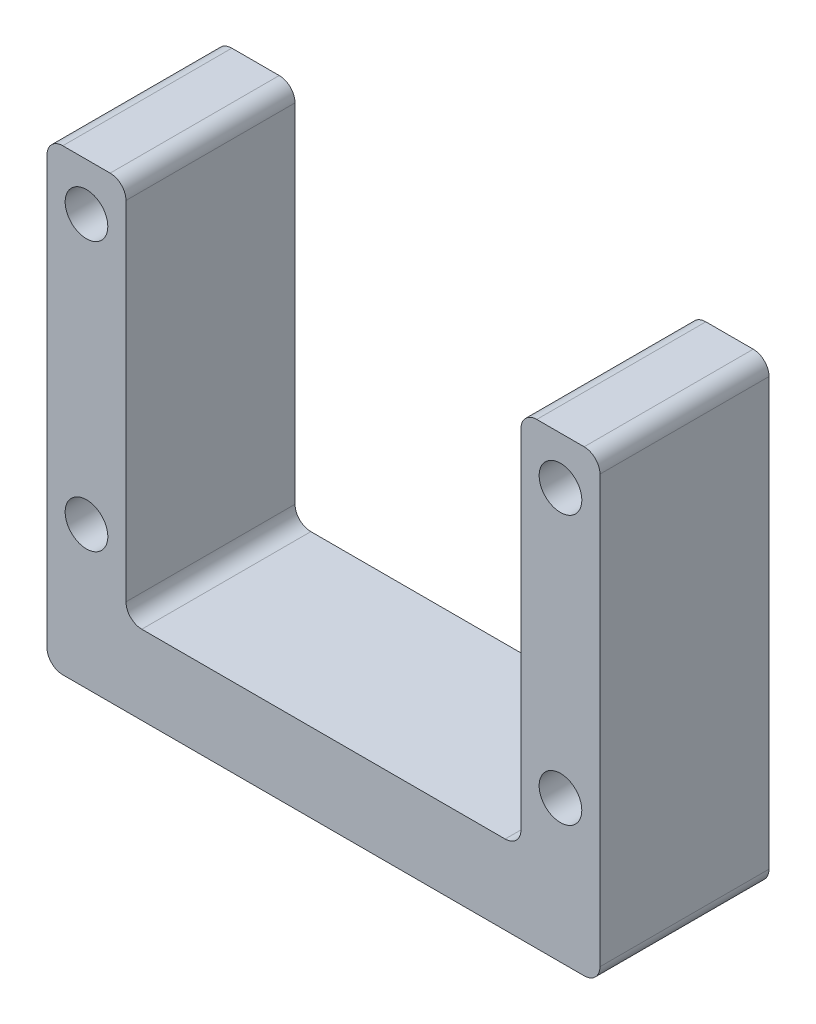
ISO-10303-21;
HEADER;
FILE_DESCRIPTION(('STEP AP214'),'2;1');
FILE_NAME('part.step','',(''),(''),'','','');
FILE_SCHEMA(('AUTOMOTIVE_DESIGN { 1 0 10303 214 1 1 1 1 }'));
ENDSEC;
DATA;
#1=APPLICATION_CONTEXT('core data for automotive mechanical design processes');
#2=APPLICATION_PROTOCOL_DEFINITION('international standard','automotive_design',2000,#1);
#3=PRODUCT_CONTEXT('',#1,'mechanical');
#4=PRODUCT('Part','Part','',(#3));
#5=PRODUCT_RELATED_PRODUCT_CATEGORY('part','',(#4));
#6=PRODUCT_DEFINITION_FORMATION('','',#4);
#7=PRODUCT_DEFINITION_CONTEXT('part definition',#1,'design');
#8=PRODUCT_DEFINITION('design','',#6,#7);
#9=PRODUCT_DEFINITION_SHAPE('','',#8);
#10=(LENGTH_UNIT() NAMED_UNIT(*) SI_UNIT(.MILLI.,.METRE.));
#11=(NAMED_UNIT(*) PLANE_ANGLE_UNIT() SI_UNIT($,.RADIAN.));
#12=(NAMED_UNIT(*) SI_UNIT($,.STERADIAN.) SOLID_ANGLE_UNIT());
#13=UNCERTAINTY_MEASURE_WITH_UNIT(LENGTH_MEASURE(1.E-05),#10,'distance_accuracy_value','');
#14=(GEOMETRIC_REPRESENTATION_CONTEXT(3) GLOBAL_UNCERTAINTY_ASSIGNED_CONTEXT((#13)) GLOBAL_UNIT_ASSIGNED_CONTEXT((#10,
#11,#12)) REPRESENTATION_CONTEXT('',''));
#15=CARTESIAN_POINT('',(0.,0.,0.));
#16=DIRECTION('',(0.,0.,1.));
#17=DIRECTION('',(1.,0.,0.));
#18=AXIS2_PLACEMENT_3D('',#15,#16,#17);
#19=CARTESIAN_POINT('',(12.5,0.,10.7));
#20=DIRECTION('',(1.,0.,0.));
#21=DIRECTION('',(0.,1.,0.));
#22=AXIS2_PLACEMENT_3D('',#19,#20,#21);
#23=PLANE('',#22);
#24=DIRECTION('',(0.,-1.,0.));
#25=VECTOR('',#24,1.);
#26=CARTESIAN_POINT('',(12.5,0.,10.7));
#27=LINE('',#26,#25);
#28=CARTESIAN_POINT('',(12.5,23.,10.7));
#29=VERTEX_POINT('',#28);
#30=CARTESIAN_POINT('',(12.5,1.,10.7));
#31=VERTEX_POINT('',#30);
#32=EDGE_CURVE('E165',#29,#31,#27,.T.);
#33=ORIENTED_EDGE('',*,*,#32,.F.);
#34=DIRECTION('',(0.,0.,-1.));
#35=VECTOR('',#34,1.);
#36=CARTESIAN_POINT('',(12.5,23.,10.7));
#37=LINE('',#36,#35);
#38=CARTESIAN_POINT('',(12.5,23.,0.));
#39=VERTEX_POINT('',#38);
#40=EDGE_CURVE('E150',#29,#39,#37,.T.);
#41=ORIENTED_EDGE('',*,*,#40,.T.);
#42=DIRECTION('',(0.,-1.,0.));
#43=VECTOR('',#42,1.);
#44=CARTESIAN_POINT('',(12.5,0.,0.));
#45=LINE('',#44,#43);
#46=CARTESIAN_POINT('',(12.5,1.,0.));
#47=VERTEX_POINT('',#46);
#48=EDGE_CURVE('E162',#39,#47,#45,.T.);
#49=ORIENTED_EDGE('',*,*,#48,.T.);
#50=DIRECTION('',(0.,0.,-1.));
#51=VECTOR('',#50,1.);
#52=CARTESIAN_POINT('',(12.5,1.,10.7));
#53=LINE('',#52,#51);
#54=EDGE_CURVE('E167',#47,#31,#53,.F.);
#55=ORIENTED_EDGE('',*,*,#54,.T.);
#56=EDGE_LOOP('',(#33,#41,#49,#55));
#57=FACE_BOUND('',#56,.T.);
#58=ADVANCED_FACE('F32',(#57),#23,.F.);
#59=CARTESIAN_POINT('',(-12.5,0.,10.7));
#60=DIRECTION('',(0.,-1.,0.));
#61=DIRECTION('',(0.,0.,-1.));
#62=AXIS2_PLACEMENT_3D('',#59,#60,#61);
#63=PLANE('',#62);
#64=DIRECTION('',(-1.,0.,0.));
#65=VECTOR('',#64,1.);
#66=CARTESIAN_POINT('',(-12.5,0.,10.7));
#67=LINE('',#66,#65);
#68=CARTESIAN_POINT('',(11.5,0.,10.7));
#69=VERTEX_POINT('',#68);
#70=CARTESIAN_POINT('',(-11.5,0.,10.7));
#71=VERTEX_POINT('',#70);
#72=EDGE_CURVE('E270',#69,#71,#67,.T.);
#73=ORIENTED_EDGE('',*,*,#72,.F.);
#74=DIRECTION('',(0.,0.,-1.));
#75=VECTOR('',#74,1.);
#76=CARTESIAN_POINT('',(11.5,0.,0.));
#77=LINE('',#76,#75);
#78=CARTESIAN_POINT('',(11.5,0.,0.));
#79=VERTEX_POINT('',#78);
#80=EDGE_CURVE('E249',#69,#79,#77,.T.);
#81=ORIENTED_EDGE('',*,*,#80,.T.);
#82=DIRECTION('',(-1.,0.,0.));
#83=VECTOR('',#82,1.);
#84=CARTESIAN_POINT('',(-12.5,0.,0.));
#85=LINE('',#84,#83);
#86=CARTESIAN_POINT('',(-11.5,0.,0.));
#87=VERTEX_POINT('',#86);
#88=EDGE_CURVE('E172',#79,#87,#85,.T.);
#89=ORIENTED_EDGE('',*,*,#88,.T.);
#90=DIRECTION('',(0.,0.,-1.));
#91=VECTOR('',#90,1.);
#92=CARTESIAN_POINT('',(-11.5,0.,10.7));
#93=LINE('',#92,#91);
#94=EDGE_CURVE('E247',#87,#71,#93,.F.);
#95=ORIENTED_EDGE('',*,*,#94,.T.);
#96=EDGE_LOOP('',(#73,#81,#89,#95));
#97=FACE_BOUND('',#96,.T.);
#98=ADVANCED_FACE('F260',(#97),#63,.F.);
#99=CARTESIAN_POINT('',(-12.5,0.,10.7));
#100=DIRECTION('',(-1.,0.,0.));
#101=DIRECTION('',(0.,-1.,0.));
#102=AXIS2_PLACEMENT_3D('',#99,#100,#101);
#103=PLANE('',#102);
#104=DIRECTION('',(0.,1.,0.));
#105=VECTOR('',#104,1.);
#106=CARTESIAN_POINT('',(-12.5,0.,0.));
#107=LINE('',#106,#105);
#108=CARTESIAN_POINT('',(-12.5,1.,0.));
#109=VERTEX_POINT('',#108);
#110=CARTESIAN_POINT('',(-12.5,23.,0.));
#111=VERTEX_POINT('',#110);
#112=EDGE_CURVE('E176',#109,#111,#107,.T.);
#113=ORIENTED_EDGE('',*,*,#112,.T.);
#114=DIRECTION('',(0.,0.,-1.));
#115=VECTOR('',#114,1.);
#116=CARTESIAN_POINT('',(-12.5,23.,10.7));
#117=LINE('',#116,#115);
#118=CARTESIAN_POINT('',(-12.5,23.,10.7));
#119=VERTEX_POINT('',#118);
#120=EDGE_CURVE('E231',#111,#119,#117,.F.);
#121=ORIENTED_EDGE('',*,*,#120,.T.);
#122=DIRECTION('',(0.,1.,0.));
#123=VECTOR('',#122,1.);
#124=CARTESIAN_POINT('',(-12.5,0.,10.7));
#125=LINE('',#124,#123);
#126=CARTESIAN_POINT('',(-12.5,1.,10.7));
#127=VERTEX_POINT('',#126);
#128=EDGE_CURVE('E268',#127,#119,#125,.T.);
#129=ORIENTED_EDGE('',*,*,#128,.F.);
#130=DIRECTION('',(0.,0.,-1.));
#131=VECTOR('',#130,1.);
#132=CARTESIAN_POINT('',(-12.5,1.,0.));
#133=LINE('',#132,#131);
#134=EDGE_CURVE('E228',#127,#109,#133,.T.);
#135=ORIENTED_EDGE('',*,*,#134,.T.);
#136=EDGE_LOOP('',(#113,#121,#129,#135));
#137=FACE_BOUND('',#136,.T.);
#138=ADVANCED_FACE('F272',(#137),#103,.F.);
#139=CARTESIAN_POINT('',(-12.5,24.,10.7));
#140=DIRECTION('',(0.,-1.,0.));
#141=DIRECTION('',(0.,0.,-1.));
#142=AXIS2_PLACEMENT_3D('',#139,#140,#141);
#143=PLANE('',#142);
#144=DIRECTION('',(-1.,0.,0.));
#145=VECTOR('',#144,1.);
#146=CARTESIAN_POINT('',(-12.5,24.,10.7));
#147=LINE('',#146,#145);
#148=CARTESIAN_POINT('',(-13.5,24.,10.7));
#149=VERTEX_POINT('',#148);
#150=CARTESIAN_POINT('',(-16.5,24.,10.7));
#151=VERTEX_POINT('',#150);
#152=EDGE_CURVE('E274',#149,#151,#147,.T.);
#153=ORIENTED_EDGE('',*,*,#152,.F.);
#154=DIRECTION('',(0.,0.,-1.));
#155=VECTOR('',#154,1.);
#156=CARTESIAN_POINT('',(-13.5,24.,10.7));
#157=LINE('',#156,#155);
#158=CARTESIAN_POINT('',(-13.5,24.,0.));
#159=VERTEX_POINT('',#158);
#160=EDGE_CURVE('E225',#149,#159,#157,.T.);
#161=ORIENTED_EDGE('',*,*,#160,.T.);
#162=DIRECTION('',(-1.,0.,0.));
#163=VECTOR('',#162,1.);
#164=CARTESIAN_POINT('',(-12.5,24.,0.));
#165=LINE('',#164,#163);
#166=CARTESIAN_POINT('',(-16.5,24.,0.));
#167=VERTEX_POINT('',#166);
#168=EDGE_CURVE('E187',#159,#167,#165,.T.);
#169=ORIENTED_EDGE('',*,*,#168,.T.);
#170=DIRECTION('',(0.,0.,-1.));
#171=VECTOR('',#170,1.);
#172=CARTESIAN_POINT('',(-16.5,24.,10.7));
#173=LINE('',#172,#171);
#174=EDGE_CURVE('E223',#167,#151,#173,.F.);
#175=ORIENTED_EDGE('',*,*,#174,.T.);
#176=EDGE_LOOP('',(#153,#161,#169,#175));
#177=FACE_BOUND('',#176,.T.);
#178=ADVANCED_FACE('F320',(#177),#143,.F.);
#179=CARTESIAN_POINT('',(-17.5,24.,10.7));
#180=DIRECTION('',(1.,0.,0.));
#181=DIRECTION('',(0.,1.,0.));
#182=AXIS2_PLACEMENT_3D('',#179,#180,#181);
#183=PLANE('',#182);
#184=DIRECTION('',(0.,-1.,0.));
#185=VECTOR('',#184,1.);
#186=CARTESIAN_POINT('',(-17.5,24.,0.));
#187=LINE('',#186,#185);
#188=CARTESIAN_POINT('',(-17.5,23.,0.));
#189=VERTEX_POINT('',#188);
#190=CARTESIAN_POINT('',(-17.5,-4.,0.));
#191=VERTEX_POINT('',#190);
#192=EDGE_CURVE('E190',#189,#191,#187,.T.);
#193=ORIENTED_EDGE('',*,*,#192,.T.);
#194=DIRECTION('',(0.,0.,-1.));
#195=VECTOR('',#194,1.);
#196=CARTESIAN_POINT('',(-17.5,-4.,10.7));
#197=LINE('',#196,#195);
#198=CARTESIAN_POINT('',(-17.5,-4.,10.7));
#199=VERTEX_POINT('',#198);
#200=EDGE_CURVE('E245',#191,#199,#197,.F.);
#201=ORIENTED_EDGE('',*,*,#200,.T.);
#202=DIRECTION('',(0.,-1.,0.));
#203=VECTOR('',#202,1.);
#204=CARTESIAN_POINT('',(-17.5,24.,10.7));
#205=LINE('',#204,#203);
#206=CARTESIAN_POINT('',(-17.5,23.,10.7));
#207=VERTEX_POINT('',#206);
#208=EDGE_CURVE('E277',#207,#199,#205,.T.);
#209=ORIENTED_EDGE('',*,*,#208,.F.);
#210=DIRECTION('',(0.,0.,-1.));
#211=VECTOR('',#210,1.);
#212=CARTESIAN_POINT('',(-17.5,23.,10.7));
#213=LINE('',#212,#211);
#214=EDGE_CURVE('E242',#207,#189,#213,.T.);
#215=ORIENTED_EDGE('',*,*,#214,.T.);
#216=EDGE_LOOP('',(#193,#201,#209,#215));
#217=FACE_BOUND('',#216,.T.);
#218=ADVANCED_FACE('F310',(#217),#183,.F.);
#219=CARTESIAN_POINT('',(17.5,-5.,10.7));
#220=DIRECTION('',(0.,1.,0.));
#221=DIRECTION('',(0.,0.,1.));
#222=AXIS2_PLACEMENT_3D('',#219,#220,#221);
#223=PLANE('',#222);
#224=DIRECTION('',(1.,0.,0.));
#225=VECTOR('',#224,1.);
#226=CARTESIAN_POINT('',(17.5,-5.,0.));
#227=LINE('',#226,#225);
#228=CARTESIAN_POINT('',(-16.5,-5.,0.));
#229=VERTEX_POINT('',#228);
#230=CARTESIAN_POINT('',(16.5,-5.,0.));
#231=VERTEX_POINT('',#230);
#232=EDGE_CURVE('E193',#229,#231,#227,.T.);
#233=ORIENTED_EDGE('',*,*,#232,.T.);
#234=DIRECTION('',(0.,0.,-1.));
#235=VECTOR('',#234,1.);
#236=CARTESIAN_POINT('',(16.5,-5.,10.7));
#237=LINE('',#236,#235);
#238=CARTESIAN_POINT('',(16.5,-5.,10.7));
#239=VERTEX_POINT('',#238);
#240=EDGE_CURVE('E240',#231,#239,#237,.F.);
#241=ORIENTED_EDGE('',*,*,#240,.T.);
#242=DIRECTION('',(1.,0.,0.));
#243=VECTOR('',#242,1.);
#244=CARTESIAN_POINT('',(17.5,-5.,10.7));
#245=LINE('',#244,#243);
#246=CARTESIAN_POINT('',(-16.5,-5.,10.7));
#247=VERTEX_POINT('',#246);
#248=EDGE_CURVE('E284',#247,#239,#245,.T.);
#249=ORIENTED_EDGE('',*,*,#248,.F.);
#250=DIRECTION('',(0.,0.,-1.));
#251=VECTOR('',#250,1.);
#252=CARTESIAN_POINT('',(-16.5,-5.,10.7));
#253=LINE('',#252,#251);
#254=EDGE_CURVE('E237',#247,#229,#253,.T.);
#255=ORIENTED_EDGE('',*,*,#254,.T.);
#256=EDGE_LOOP('',(#233,#241,#249,#255));
#257=FACE_BOUND('',#256,.T.);
#258=ADVANCED_FACE('F301',(#257),#223,.F.);
#259=CARTESIAN_POINT('',(17.5,24.,10.7));
#260=DIRECTION('',(-1.,0.,0.));
#261=DIRECTION('',(0.,-1.,0.));
#262=AXIS2_PLACEMENT_3D('',#259,#260,#261);
#263=PLANE('',#262);
#264=DIRECTION('',(0.,1.,0.));
#265=VECTOR('',#264,1.);
#266=CARTESIAN_POINT('',(17.5,24.,10.7));
#267=LINE('',#266,#265);
#268=CARTESIAN_POINT('',(17.5,-4.,10.7));
#269=VERTEX_POINT('',#268);
#270=CARTESIAN_POINT('',(17.5,23.,10.7));
#271=VERTEX_POINT('',#270);
#272=EDGE_CURVE('E285',#269,#271,#267,.T.);
#273=ORIENTED_EDGE('',*,*,#272,.F.);
#274=DIRECTION('',(0.,0.,-1.));
#275=VECTOR('',#274,1.);
#276=CARTESIAN_POINT('',(17.5,-4.,10.7));
#277=LINE('',#276,#275);
#278=CARTESIAN_POINT('',(17.5,-4.,0.));
#279=VERTEX_POINT('',#278);
#280=EDGE_CURVE('E234',#269,#279,#277,.T.);
#281=ORIENTED_EDGE('',*,*,#280,.T.);
#282=DIRECTION('',(0.,1.,0.));
#283=VECTOR('',#282,1.);
#284=CARTESIAN_POINT('',(17.5,24.,0.));
#285=LINE('',#284,#283);
#286=CARTESIAN_POINT('',(17.5,23.,0.));
#287=VERTEX_POINT('',#286);
#288=EDGE_CURVE('E196',#279,#287,#285,.T.);
#289=ORIENTED_EDGE('',*,*,#288,.T.);
#290=DIRECTION('',(0.,0.,-1.));
#291=VECTOR('',#290,1.);
#292=CARTESIAN_POINT('',(17.5,23.,10.7));
#293=LINE('',#292,#291);
#294=EDGE_CURVE('E47',#287,#271,#293,.F.);
#295=ORIENTED_EDGE('',*,*,#294,.T.);
#296=EDGE_LOOP('',(#273,#281,#289,#295));
#297=FACE_BOUND('',#296,.T.);
#298=ADVANCED_FACE('F294',(#297),#263,.F.);
#299=CARTESIAN_POINT('',(12.5,24.,10.7));
#300=DIRECTION('',(0.,-1.,0.));
#301=DIRECTION('',(0.,0.,-1.));
#302=AXIS2_PLACEMENT_3D('',#299,#300,#301);
#303=PLANE('',#302);
#304=DIRECTION('',(-1.,0.,0.));
#305=VECTOR('',#304,1.);
#306=CARTESIAN_POINT('',(12.5,24.,0.));
#307=LINE('',#306,#305);
#308=CARTESIAN_POINT('',(16.5,24.,0.));
#309=VERTEX_POINT('',#308);
#310=CARTESIAN_POINT('',(13.5,24.,0.));
#311=VERTEX_POINT('',#310);
#312=EDGE_CURVE('E198',#309,#311,#307,.T.);
#313=ORIENTED_EDGE('',*,*,#312,.T.);
#314=DIRECTION('',(0.,0.,-1.));
#315=VECTOR('',#314,1.);
#316=CARTESIAN_POINT('',(13.5,24.,10.7));
#317=LINE('',#316,#315);
#318=CARTESIAN_POINT('',(13.5,24.,10.7));
#319=VERTEX_POINT('',#318);
#320=EDGE_CURVE('E151',#311,#319,#317,.F.);
#321=ORIENTED_EDGE('',*,*,#320,.T.);
#322=DIRECTION('',(-1.,0.,0.));
#323=VECTOR('',#322,1.);
#324=CARTESIAN_POINT('',(12.5,24.,10.7));
#325=LINE('',#324,#323);
#326=CARTESIAN_POINT('',(16.5,24.,10.7));
#327=VERTEX_POINT('',#326);
#328=EDGE_CURVE('E182',#327,#319,#325,.T.);
#329=ORIENTED_EDGE('',*,*,#328,.F.);
#330=DIRECTION('',(0.,0.,-1.));
#331=VECTOR('',#330,1.);
#332=CARTESIAN_POINT('',(16.5,24.,10.7));
#333=LINE('',#332,#331);
#334=EDGE_CURVE('E156',#327,#309,#333,.T.);
#335=ORIENTED_EDGE('',*,*,#334,.T.);
#336=EDGE_LOOP('',(#313,#321,#329,#335));
#337=FACE_BOUND('',#336,.T.);
#338=ADVANCED_FACE('F290',(#337),#303,.F.);
#339=CARTESIAN_POINT('',(0.,0.,10.7));
#340=DIRECTION('',(0.,0.,-1.));
#341=DIRECTION('',(-1.,0.,0.));
#342=AXIS2_PLACEMENT_3D('',#339,#340,#341);
#343=PLANE('',#342);
#344=CARTESIAN_POINT('',(-15.,4.,10.7));
#345=DIRECTION('',(0.,0.,-1.));
#346=DIRECTION('',(-1.,0.,0.));
#347=AXIS2_PLACEMENT_3D('',#344,#345,#346);
#348=CIRCLE('',#347,1.35);
#349=CARTESIAN_POINT('',(-16.35,4.,10.7));
#350=VERTEX_POINT('',#349);
#351=EDGE_CURVE('E380',#350,#350,#348,.T.);
#352=ORIENTED_EDGE('',*,*,#351,.T.);
#353=EDGE_LOOP('',(#352));
#354=FACE_BOUND('',#353,.T.);
#355=CARTESIAN_POINT('',(15.,4.00000000000001,10.7));
#356=DIRECTION('',(0.,0.,-1.));
#357=DIRECTION('',(-1.,0.,0.));
#358=AXIS2_PLACEMENT_3D('',#355,#356,#357);
#359=CIRCLE('',#358,1.35);
#360=CARTESIAN_POINT('',(13.65,4.00000000000001,10.7));
#361=VERTEX_POINT('',#360);
#362=EDGE_CURVE('E381',#361,#361,#359,.T.);
#363=ORIENTED_EDGE('',*,*,#362,.T.);
#364=EDGE_LOOP('',(#363));
#365=FACE_BOUND('',#364,.T.);
#366=CARTESIAN_POINT('',(15.,21.,10.7));
#367=DIRECTION('',(0.,0.,-1.));
#368=DIRECTION('',(-1.,0.,0.));
#369=AXIS2_PLACEMENT_3D('',#366,#367,#368);
#370=CIRCLE('',#369,1.35);
#371=CARTESIAN_POINT('',(13.65,21.,10.7));
#372=VERTEX_POINT('',#371);
#373=EDGE_CURVE('E386',#372,#372,#370,.T.);
#374=ORIENTED_EDGE('',*,*,#373,.T.);
#375=EDGE_LOOP('',(#374));
#376=FACE_BOUND('',#375,.T.);
#377=CARTESIAN_POINT('',(-15.,21.,10.7));
#378=DIRECTION('',(0.,0.,-1.));
#379=DIRECTION('',(-1.,0.,0.));
#380=AXIS2_PLACEMENT_3D('',#377,#378,#379);
#381=CIRCLE('',#380,1.35);
#382=CARTESIAN_POINT('',(-16.35,21.,10.7));
#383=VERTEX_POINT('',#382);
#384=EDGE_CURVE('E173',#383,#383,#381,.T.);
#385=ORIENTED_EDGE('',*,*,#384,.T.);
#386=EDGE_LOOP('',(#385));
#387=FACE_BOUND('',#386,.T.);
#388=ORIENTED_EDGE('',*,*,#328,.T.);
#389=CARTESIAN_POINT('',(13.5,23.,10.7));
#390=DIRECTION('',(0.,0.,-1.));
#391=DIRECTION('',(-1.,0.,0.));
#392=AXIS2_PLACEMENT_3D('',#389,#390,#391);
#393=CIRCLE('',#392,1.);
#394=EDGE_CURVE('E221',#319,#29,#393,.F.);
#395=ORIENTED_EDGE('',*,*,#394,.T.);
#396=ORIENTED_EDGE('',*,*,#32,.T.);
#397=CARTESIAN_POINT('',(11.5,1.,10.7));
#398=DIRECTION('',(0.,0.,-1.));
#399=DIRECTION('',(-1.,0.,0.));
#400=AXIS2_PLACEMENT_3D('',#397,#398,#399);
#401=CIRCLE('',#400,1.);
#402=EDGE_CURVE('E253',#31,#69,#401,.T.);
#403=ORIENTED_EDGE('',*,*,#402,.T.);
#404=ORIENTED_EDGE('',*,*,#72,.T.);
#405=CARTESIAN_POINT('',(-11.5,1.,10.7));
#406=DIRECTION('',(0.,0.,-1.));
#407=DIRECTION('',(-1.,0.,0.));
#408=AXIS2_PLACEMENT_3D('',#405,#406,#407);
#409=CIRCLE('',#408,1.);
#410=EDGE_CURVE('E11',#71,#127,#409,.T.);
#411=ORIENTED_EDGE('',*,*,#410,.T.);
#412=ORIENTED_EDGE('',*,*,#128,.T.);
#413=CARTESIAN_POINT('',(-13.5,23.,10.7));
#414=DIRECTION('',(0.,0.,-1.));
#415=DIRECTION('',(-1.,0.,0.));
#416=AXIS2_PLACEMENT_3D('',#413,#414,#415);
#417=CIRCLE('',#416,1.);
#418=EDGE_CURVE('E219',#119,#149,#417,.F.);
#419=ORIENTED_EDGE('',*,*,#418,.T.);
#420=ORIENTED_EDGE('',*,*,#152,.T.);
#421=CARTESIAN_POINT('',(-16.5,23.,10.7));
#422=DIRECTION('',(0.,0.,-1.));
#423=DIRECTION('',(-1.,0.,0.));
#424=AXIS2_PLACEMENT_3D('',#421,#422,#423);
#425=CIRCLE('',#424,1.);
#426=EDGE_CURVE('E214',#151,#207,#425,.F.);
#427=ORIENTED_EDGE('',*,*,#426,.T.);
#428=ORIENTED_EDGE('',*,*,#208,.T.);
#429=CARTESIAN_POINT('',(-16.5,-4.,10.7));
#430=DIRECTION('',(0.,0.,-1.));
#431=DIRECTION('',(-1.,0.,0.));
#432=AXIS2_PLACEMENT_3D('',#429,#430,#431);
#433=CIRCLE('',#432,1.);
#434=EDGE_CURVE('E216',#199,#247,#433,.F.);
#435=ORIENTED_EDGE('',*,*,#434,.T.);
#436=ORIENTED_EDGE('',*,*,#248,.T.);
#437=CARTESIAN_POINT('',(16.5,-4.,10.7));
#438=DIRECTION('',(0.,0.,-1.));
#439=DIRECTION('',(-1.,0.,0.));
#440=AXIS2_PLACEMENT_3D('',#437,#438,#439);
#441=CIRCLE('',#440,1.);
#442=EDGE_CURVE('E54',#239,#269,#441,.F.);
#443=ORIENTED_EDGE('',*,*,#442,.T.);
#444=ORIENTED_EDGE('',*,*,#272,.T.);
#445=CARTESIAN_POINT('',(16.5,23.,10.7));
#446=DIRECTION('',(0.,0.,-1.));
#447=DIRECTION('',(-1.,0.,0.));
#448=AXIS2_PLACEMENT_3D('',#445,#446,#447);
#449=CIRCLE('',#448,1.);
#450=EDGE_CURVE('E212',#271,#327,#449,.F.);
#451=ORIENTED_EDGE('',*,*,#450,.T.);
#452=EDGE_LOOP('',(#388,#395,#396,#403,#404,#411,#412,#419,#420,#427,#428,#435,#436,#443,#444,#451));
#453=FACE_BOUND('',#452,.T.);
#454=ADVANCED_FACE('F267',(#354,#365,#376,#387,#453),#343,.F.);
#455=CARTESIAN_POINT('',(0.,0.,0.));
#456=DIRECTION('',(0.,0.,-1.));
#457=DIRECTION('',(-1.,0.,0.));
#458=AXIS2_PLACEMENT_3D('',#455,#456,#457);
#459=PLANE('',#458);
#460=CARTESIAN_POINT('',(-15.,4.,0.));
#461=DIRECTION('',(0.,0.,1.));
#462=DIRECTION('',(-1.,0.,0.));
#463=AXIS2_PLACEMENT_3D('',#460,#461,#462);
#464=CIRCLE('',#463,1.35);
#465=CARTESIAN_POINT('',(-16.35,4.,0.));
#466=VERTEX_POINT('',#465);
#467=EDGE_CURVE('E377',#466,#466,#464,.T.);
#468=ORIENTED_EDGE('',*,*,#467,.T.);
#469=EDGE_LOOP('',(#468));
#470=FACE_BOUND('',#469,.T.);
#471=CARTESIAN_POINT('',(15.,4.00000000000001,0.));
#472=DIRECTION('',(0.,0.,1.));
#473=DIRECTION('',(1.,0.,0.));
#474=AXIS2_PLACEMENT_3D('',#471,#472,#473);
#475=CIRCLE('',#474,1.35);
#476=CARTESIAN_POINT('',(16.35,4.00000000000001,0.));
#477=VERTEX_POINT('',#476);
#478=EDGE_CURVE('E531',#477,#477,#475,.T.);
#479=ORIENTED_EDGE('',*,*,#478,.T.);
#480=EDGE_LOOP('',(#479));
#481=FACE_BOUND('',#480,.T.);
#482=CARTESIAN_POINT('',(15.,21.,0.));
#483=DIRECTION('',(0.,0.,1.));
#484=DIRECTION('',(-1.,0.,0.));
#485=AXIS2_PLACEMENT_3D('',#482,#483,#484);
#486=CIRCLE('',#485,1.35);
#487=CARTESIAN_POINT('',(13.65,21.,0.));
#488=VERTEX_POINT('',#487);
#489=EDGE_CURVE('E528',#488,#488,#486,.T.);
#490=ORIENTED_EDGE('',*,*,#489,.T.);
#491=EDGE_LOOP('',(#490));
#492=FACE_BOUND('',#491,.T.);
#493=CARTESIAN_POINT('',(-15.,21.,0.));
#494=DIRECTION('',(0.,0.,1.));
#495=DIRECTION('',(1.,0.,0.));
#496=AXIS2_PLACEMENT_3D('',#493,#494,#495);
#497=CIRCLE('',#496,1.35);
#498=CARTESIAN_POINT('',(-13.65,21.,0.));
#499=VERTEX_POINT('',#498);
#500=EDGE_CURVE('E179',#499,#499,#497,.T.);
#501=ORIENTED_EDGE('',*,*,#500,.T.);
#502=EDGE_LOOP('',(#501));
#503=FACE_BOUND('',#502,.T.);
#504=ORIENTED_EDGE('',*,*,#48,.F.);
#505=CARTESIAN_POINT('',(13.5,23.,0.));
#506=DIRECTION('',(0.,0.,-1.));
#507=DIRECTION('',(-1.,0.,0.));
#508=AXIS2_PLACEMENT_3D('',#505,#506,#507);
#509=CIRCLE('',#508,1.);
#510=EDGE_CURVE('E146',#39,#311,#509,.T.);
#511=ORIENTED_EDGE('',*,*,#510,.T.);
#512=ORIENTED_EDGE('',*,*,#312,.F.);
#513=CARTESIAN_POINT('',(16.5,23.,0.));
#514=DIRECTION('',(0.,0.,-1.));
#515=DIRECTION('',(-1.,0.,0.));
#516=AXIS2_PLACEMENT_3D('',#513,#514,#515);
#517=CIRCLE('',#516,1.);
#518=EDGE_CURVE('E166',#309,#287,#517,.T.);
#519=ORIENTED_EDGE('',*,*,#518,.T.);
#520=ORIENTED_EDGE('',*,*,#288,.F.);
#521=CARTESIAN_POINT('',(16.5,-4.,0.));
#522=DIRECTION('',(0.,0.,-1.));
#523=DIRECTION('',(-1.,0.,0.));
#524=AXIS2_PLACEMENT_3D('',#521,#522,#523);
#525=CIRCLE('',#524,1.);
#526=EDGE_CURVE('E206',#279,#231,#525,.T.);
#527=ORIENTED_EDGE('',*,*,#526,.T.);
#528=ORIENTED_EDGE('',*,*,#232,.F.);
#529=CARTESIAN_POINT('',(-16.5,-4.,0.));
#530=DIRECTION('',(0.,0.,-1.));
#531=DIRECTION('',(-1.,0.,0.));
#532=AXIS2_PLACEMENT_3D('',#529,#530,#531);
#533=CIRCLE('',#532,1.);
#534=EDGE_CURVE('E204',#229,#191,#533,.T.);
#535=ORIENTED_EDGE('',*,*,#534,.T.);
#536=ORIENTED_EDGE('',*,*,#192,.F.);
#537=CARTESIAN_POINT('',(-16.5,23.,0.));
#538=DIRECTION('',(0.,0.,-1.));
#539=DIRECTION('',(-1.,0.,0.));
#540=AXIS2_PLACEMENT_3D('',#537,#538,#539);
#541=CIRCLE('',#540,1.);
#542=EDGE_CURVE('E202',#189,#167,#541,.T.);
#543=ORIENTED_EDGE('',*,*,#542,.T.);
#544=ORIENTED_EDGE('',*,*,#168,.F.);
#545=CARTESIAN_POINT('',(-13.5,23.,0.));
#546=DIRECTION('',(0.,0.,-1.));
#547=DIRECTION('',(-1.,0.,0.));
#548=AXIS2_PLACEMENT_3D('',#545,#546,#547);
#549=CIRCLE('',#548,1.);
#550=EDGE_CURVE('E157',#159,#111,#549,.T.);
#551=ORIENTED_EDGE('',*,*,#550,.T.);
#552=ORIENTED_EDGE('',*,*,#112,.F.);
#553=CARTESIAN_POINT('',(-11.5,1.,0.));
#554=DIRECTION('',(0.,0.,-1.));
#555=DIRECTION('',(-1.,0.,0.));
#556=AXIS2_PLACEMENT_3D('',#553,#554,#555);
#557=CIRCLE('',#556,1.);
#558=EDGE_CURVE('E40',#109,#87,#557,.F.);
#559=ORIENTED_EDGE('',*,*,#558,.T.);
#560=ORIENTED_EDGE('',*,*,#88,.F.);
#561=CARTESIAN_POINT('',(11.5,1.,0.));
#562=DIRECTION('',(0.,0.,-1.));
#563=DIRECTION('',(-1.,0.,0.));
#564=AXIS2_PLACEMENT_3D('',#561,#562,#563);
#565=CIRCLE('',#564,1.);
#566=EDGE_CURVE('E171',#79,#47,#565,.F.);
#567=ORIENTED_EDGE('',*,*,#566,.T.);
#568=EDGE_LOOP('',(#504,#511,#512,#519,#520,#527,#528,#535,#536,#543,#544,#551,#552,#559,#560,#567));
#569=FACE_BOUND('',#568,.T.);
#570=ADVANCED_FACE('F169',(#470,#481,#492,#503,#569),#459,.T.);
#571=CARTESIAN_POINT('',(-15.,21.,0.));
#572=DIRECTION('',(0.,0.,1.));
#573=DIRECTION('',(1.,0.,0.));
#574=AXIS2_PLACEMENT_3D('',#571,#572,#573);
#575=CYLINDRICAL_SURFACE('',#574,1.35);
#576=ORIENTED_EDGE('',*,*,#500,.F.);
#577=EDGE_LOOP('',(#576));
#578=FACE_BOUND('',#577,.T.);
#579=ORIENTED_EDGE('',*,*,#384,.F.);
#580=EDGE_LOOP('',(#579));
#581=FACE_BOUND('',#580,.T.);
#582=ADVANCED_FACE('F354',(#578,#581),#575,.F.);
#583=CARTESIAN_POINT('',(15.,21.,0.));
#584=DIRECTION('',(0.,0.,1.));
#585=DIRECTION('',(1.,0.,0.));
#586=AXIS2_PLACEMENT_3D('',#583,#584,#585);
#587=CYLINDRICAL_SURFACE('',#586,1.35);
#588=ORIENTED_EDGE('',*,*,#489,.F.);
#589=EDGE_LOOP('',(#588));
#590=FACE_BOUND('',#589,.T.);
#591=ORIENTED_EDGE('',*,*,#373,.F.);
#592=EDGE_LOOP('',(#591));
#593=FACE_BOUND('',#592,.T.);
#594=ADVANCED_FACE('F361',(#590,#593),#587,.F.);
#595=CARTESIAN_POINT('',(15.,4.00000000000001,0.));
#596=DIRECTION('',(0.,0.,1.));
#597=DIRECTION('',(1.,0.,0.));
#598=AXIS2_PLACEMENT_3D('',#595,#596,#597);
#599=CYLINDRICAL_SURFACE('',#598,1.35);
#600=ORIENTED_EDGE('',*,*,#478,.F.);
#601=EDGE_LOOP('',(#600));
#602=FACE_BOUND('',#601,.T.);
#603=ORIENTED_EDGE('',*,*,#362,.F.);
#604=EDGE_LOOP('',(#603));
#605=FACE_BOUND('',#604,.T.);
#606=ADVANCED_FACE('F365',(#602,#605),#599,.F.);
#607=CARTESIAN_POINT('',(-15.,4.,0.));
#608=DIRECTION('',(0.,0.,1.));
#609=DIRECTION('',(1.,0.,0.));
#610=AXIS2_PLACEMENT_3D('',#607,#608,#609);
#611=CYLINDRICAL_SURFACE('',#610,1.35);
#612=ORIENTED_EDGE('',*,*,#467,.F.);
#613=EDGE_LOOP('',(#612));
#614=FACE_BOUND('',#613,.T.);
#615=ORIENTED_EDGE('',*,*,#351,.F.);
#616=EDGE_LOOP('',(#615));
#617=FACE_BOUND('',#616,.T.);
#618=ADVANCED_FACE('F331',(#614,#617),#611,.F.);
#619=CARTESIAN_POINT('',(13.5,23.,10.7));
#620=DIRECTION('',(0.,0.,-1.));
#621=DIRECTION('',(-1.,0.,0.));
#622=AXIS2_PLACEMENT_3D('',#619,#620,#621);
#623=CYLINDRICAL_SURFACE('',#622,1.);
#624=ORIENTED_EDGE('',*,*,#394,.F.);
#625=ORIENTED_EDGE('',*,*,#320,.F.);
#626=ORIENTED_EDGE('',*,*,#510,.F.);
#627=ORIENTED_EDGE('',*,*,#40,.F.);
#628=EDGE_LOOP('',(#624,#625,#626,#627));
#629=FACE_BOUND('',#628,.T.);
#630=ADVANCED_FACE('F149',(#629),#623,.T.);
#631=CARTESIAN_POINT('',(-13.5,23.,10.7));
#632=DIRECTION('',(0.,0.,-1.));
#633=DIRECTION('',(-1.,0.,0.));
#634=AXIS2_PLACEMENT_3D('',#631,#632,#633);
#635=CYLINDRICAL_SURFACE('',#634,1.);
#636=ORIENTED_EDGE('',*,*,#418,.F.);
#637=ORIENTED_EDGE('',*,*,#120,.F.);
#638=ORIENTED_EDGE('',*,*,#550,.F.);
#639=ORIENTED_EDGE('',*,*,#160,.F.);
#640=EDGE_LOOP('',(#636,#637,#638,#639));
#641=FACE_BOUND('',#640,.T.);
#642=ADVANCED_FACE('F323',(#641),#635,.T.);
#643=CARTESIAN_POINT('',(16.5,-4.,10.7));
#644=DIRECTION('',(0.,0.,-1.));
#645=DIRECTION('',(-1.,0.,0.));
#646=AXIS2_PLACEMENT_3D('',#643,#644,#645);
#647=CYLINDRICAL_SURFACE('',#646,1.);
#648=ORIENTED_EDGE('',*,*,#442,.F.);
#649=ORIENTED_EDGE('',*,*,#240,.F.);
#650=ORIENTED_EDGE('',*,*,#526,.F.);
#651=ORIENTED_EDGE('',*,*,#280,.F.);
#652=EDGE_LOOP('',(#648,#649,#650,#651));
#653=FACE_BOUND('',#652,.T.);
#654=ADVANCED_FACE('F297',(#653),#647,.T.);
#655=CARTESIAN_POINT('',(-16.5,-4.,10.7));
#656=DIRECTION('',(0.,0.,-1.));
#657=DIRECTION('',(-1.,0.,0.));
#658=AXIS2_PLACEMENT_3D('',#655,#656,#657);
#659=CYLINDRICAL_SURFACE('',#658,1.);
#660=ORIENTED_EDGE('',*,*,#434,.F.);
#661=ORIENTED_EDGE('',*,*,#200,.F.);
#662=ORIENTED_EDGE('',*,*,#534,.F.);
#663=ORIENTED_EDGE('',*,*,#254,.F.);
#664=EDGE_LOOP('',(#660,#661,#662,#663));
#665=FACE_BOUND('',#664,.T.);
#666=ADVANCED_FACE('F306',(#665),#659,.T.);
#667=CARTESIAN_POINT('',(-16.5,23.,10.7));
#668=DIRECTION('',(0.,0.,-1.));
#669=DIRECTION('',(-1.,0.,0.));
#670=AXIS2_PLACEMENT_3D('',#667,#668,#669);
#671=CYLINDRICAL_SURFACE('',#670,1.);
#672=ORIENTED_EDGE('',*,*,#426,.F.);
#673=ORIENTED_EDGE('',*,*,#174,.F.);
#674=ORIENTED_EDGE('',*,*,#542,.F.);
#675=ORIENTED_EDGE('',*,*,#214,.F.);
#676=EDGE_LOOP('',(#672,#673,#674,#675));
#677=FACE_BOUND('',#676,.T.);
#678=ADVANCED_FACE('F315',(#677),#671,.T.);
#679=CARTESIAN_POINT('',(16.5,23.,10.7));
#680=DIRECTION('',(0.,0.,-1.));
#681=DIRECTION('',(-1.,0.,0.));
#682=AXIS2_PLACEMENT_3D('',#679,#680,#681);
#683=CYLINDRICAL_SURFACE('',#682,1.);
#684=ORIENTED_EDGE('',*,*,#450,.F.);
#685=ORIENTED_EDGE('',*,*,#294,.F.);
#686=ORIENTED_EDGE('',*,*,#518,.F.);
#687=ORIENTED_EDGE('',*,*,#334,.F.);
#688=EDGE_LOOP('',(#684,#685,#686,#687));
#689=FACE_BOUND('',#688,.T.);
#690=ADVANCED_FACE('F292',(#689),#683,.T.);
#691=CARTESIAN_POINT('',(11.5,1.,10.7));
#692=DIRECTION('',(0.,0.,1.));
#693=DIRECTION('',(1.,0.,0.));
#694=AXIS2_PLACEMENT_3D('',#691,#692,#693);
#695=CYLINDRICAL_SURFACE('',#694,1.);
#696=ORIENTED_EDGE('',*,*,#402,.F.);
#697=ORIENTED_EDGE('',*,*,#54,.F.);
#698=ORIENTED_EDGE('',*,*,#566,.F.);
#699=ORIENTED_EDGE('',*,*,#80,.F.);
#700=EDGE_LOOP('',(#696,#697,#698,#699));
#701=FACE_BOUND('',#700,.T.);
#702=ADVANCED_FACE('F391',(#701),#695,.F.);
#703=CARTESIAN_POINT('',(-11.5,1.,10.7));
#704=DIRECTION('',(0.,0.,1.));
#705=DIRECTION('',(1.,0.,0.));
#706=AXIS2_PLACEMENT_3D('',#703,#704,#705);
#707=CYLINDRICAL_SURFACE('',#706,1.);
#708=ORIENTED_EDGE('',*,*,#410,.F.);
#709=ORIENTED_EDGE('',*,*,#94,.F.);
#710=ORIENTED_EDGE('',*,*,#558,.F.);
#711=ORIENTED_EDGE('',*,*,#134,.F.);
#712=EDGE_LOOP('',(#708,#709,#710,#711));
#713=FACE_BOUND('',#712,.T.);
#714=ADVANCED_FACE('F34',(#713),#707,.F.);
#715=CLOSED_SHELL('',(#58,#98,#138,#178,#218,#258,#298,#338,#454,#570,#582,#594,#606,#618,#630,
#642,#654,#666,#678,#690,#702,#714));
#716=MANIFOLD_SOLID_BREP('B2',#715);
#717=ADVANCED_BREP_SHAPE_REPRESENTATION('',(#18,#716),#14);
#718=SHAPE_DEFINITION_REPRESENTATION(#9,#717);
ENDSEC;
END-ISO-10303-21;
